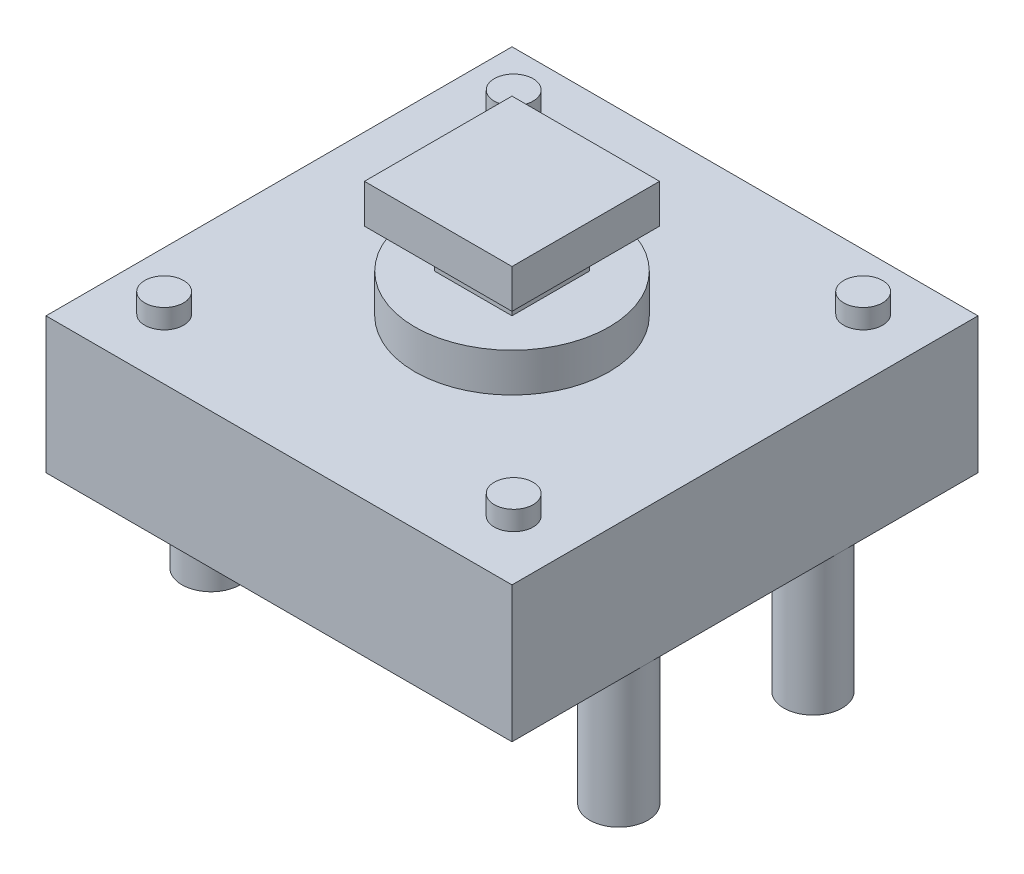
ISO-10303-21;
HEADER;
FILE_DESCRIPTION(('STEP AP214'),'2;1');
FILE_NAME('part.step','',(''),(''),'','','');
FILE_SCHEMA(('AUTOMOTIVE_DESIGN { 1 0 10303 214 1 1 1 1 }'));
ENDSEC;
DATA;
#1=APPLICATION_CONTEXT('core data for automotive mechanical design processes');
#2=APPLICATION_PROTOCOL_DEFINITION('international standard','automotive_design',2000,#1);
#3=PRODUCT_CONTEXT('',#1,'mechanical');
#4=PRODUCT('Part','Part','',(#3));
#5=PRODUCT_RELATED_PRODUCT_CATEGORY('part','',(#4));
#6=PRODUCT_DEFINITION_FORMATION('','',#4);
#7=PRODUCT_DEFINITION_CONTEXT('part definition',#1,'design');
#8=PRODUCT_DEFINITION('design','',#6,#7);
#9=PRODUCT_DEFINITION_SHAPE('','',#8);
#10=(LENGTH_UNIT() NAMED_UNIT(*) SI_UNIT(.MILLI.,.METRE.));
#11=(NAMED_UNIT(*) PLANE_ANGLE_UNIT() SI_UNIT($,.RADIAN.));
#12=(NAMED_UNIT(*) SI_UNIT($,.STERADIAN.) SOLID_ANGLE_UNIT());
#13=UNCERTAINTY_MEASURE_WITH_UNIT(LENGTH_MEASURE(1.E-05),#10,'distance_accuracy_value','');
#14=(GEOMETRIC_REPRESENTATION_CONTEXT(3) GLOBAL_UNCERTAINTY_ASSIGNED_CONTEXT((#13)) GLOBAL_UNIT_ASSIGNED_CONTEXT((#10,
#11,#12)) REPRESENTATION_CONTEXT('',''));
#15=CARTESIAN_POINT('',(0.,0.,0.));
#16=DIRECTION('',(0.,0.,1.));
#17=DIRECTION('',(1.,0.,0.));
#18=AXIS2_PLACEMENT_3D('',#15,#16,#17);
#19=CARTESIAN_POINT('',(-6.,3.5,6.));
#20=DIRECTION('',(1.,0.,0.));
#21=DIRECTION('',(0.,0.,-1.));
#22=AXIS2_PLACEMENT_3D('',#19,#20,#21);
#23=PLANE('',#22);
#24=DIRECTION('',(0.,0.,1.));
#25=VECTOR('',#24,1.);
#26=CARTESIAN_POINT('',(-6.,0.,6.));
#27=LINE('',#26,#25);
#28=CARTESIAN_POINT('',(-6.,0.,-6.));
#29=VERTEX_POINT('',#28);
#30=CARTESIAN_POINT('',(-6.,0.,-2.5));
#31=VERTEX_POINT('',#30);
#32=EDGE_CURVE('E196',#29,#31,#27,.T.);
#33=ORIENTED_EDGE('',*,*,#32,.T.);
#34=CARTESIAN_POINT('',(-6.,0.,2.5));
#35=VERTEX_POINT('',#34);
#36=EDGE_CURVE('E192',#31,#35,#27,.T.);
#37=ORIENTED_EDGE('',*,*,#36,.T.);
#38=CARTESIAN_POINT('',(-6.,0.,6.));
#39=VERTEX_POINT('',#38);
#40=EDGE_CURVE('E190',#35,#39,#27,.T.);
#41=ORIENTED_EDGE('',*,*,#40,.T.);
#42=DIRECTION('',(0.,-1.,0.));
#43=VECTOR('',#42,1.);
#44=CARTESIAN_POINT('',(-6.,3.5,6.));
#45=LINE('',#44,#43);
#46=CARTESIAN_POINT('',(-6.,3.5,6.));
#47=VERTEX_POINT('',#46);
#48=EDGE_CURVE('E44',#47,#39,#45,.T.);
#49=ORIENTED_EDGE('',*,*,#48,.F.);
#50=DIRECTION('',(0.,0.,1.));
#51=VECTOR('',#50,1.);
#52=CARTESIAN_POINT('',(-6.,3.5,6.));
#53=LINE('',#52,#51);
#54=CARTESIAN_POINT('',(-6.,3.5,-6.));
#55=VERTEX_POINT('',#54);
#56=EDGE_CURVE('E170',#55,#47,#53,.T.);
#57=ORIENTED_EDGE('',*,*,#56,.F.);
#58=DIRECTION('',(0.,-1.,0.));
#59=VECTOR('',#58,1.);
#60=CARTESIAN_POINT('',(-6.,3.5,-6.));
#61=LINE('',#60,#59);
#62=EDGE_CURVE('E171',#55,#29,#61,.T.);
#63=ORIENTED_EDGE('',*,*,#62,.T.);
#64=EDGE_LOOP('',(#33,#37,#41,#49,#57,#63));
#65=FACE_BOUND('',#64,.T.);
#66=ADVANCED_FACE('F41',(#65),#23,.F.);
#67=CARTESIAN_POINT('',(6.,3.5,6.));
#68=DIRECTION('',(0.,0.,-1.));
#69=DIRECTION('',(-1.,0.,0.));
#70=AXIS2_PLACEMENT_3D('',#67,#68,#69);
#71=PLANE('',#70);
#72=DIRECTION('',(1.,0.,0.));
#73=VECTOR('',#72,1.);
#74=CARTESIAN_POINT('',(6.,0.,6.));
#75=LINE('',#74,#73);
#76=CARTESIAN_POINT('',(6.,0.,6.));
#77=VERTEX_POINT('',#76);
#78=EDGE_CURVE('E164',#39,#77,#75,.T.);
#79=ORIENTED_EDGE('',*,*,#78,.T.);
#80=DIRECTION('',(0.,-1.,0.));
#81=VECTOR('',#80,1.);
#82=CARTESIAN_POINT('',(6.,3.5,6.));
#83=LINE('',#82,#81);
#84=CARTESIAN_POINT('',(6.,3.5,6.));
#85=VERTEX_POINT('',#84);
#86=EDGE_CURVE('E148',#85,#77,#83,.T.);
#87=ORIENTED_EDGE('',*,*,#86,.F.);
#88=DIRECTION('',(1.,0.,0.));
#89=VECTOR('',#88,1.);
#90=CARTESIAN_POINT('',(6.,3.5,6.));
#91=LINE('',#90,#89);
#92=EDGE_CURVE('E185',#47,#85,#91,.T.);
#93=ORIENTED_EDGE('',*,*,#92,.F.);
#94=ORIENTED_EDGE('',*,*,#48,.T.);
#95=EDGE_LOOP('',(#79,#87,#93,#94));
#96=FACE_BOUND('',#95,.T.);
#97=ADVANCED_FACE('F184',(#96),#71,.F.);
#98=CARTESIAN_POINT('',(6.,3.5,6.));
#99=DIRECTION('',(-1.,0.,0.));
#100=DIRECTION('',(0.,0.,1.));
#101=AXIS2_PLACEMENT_3D('',#98,#99,#100);
#102=PLANE('',#101);
#103=DIRECTION('',(0.,0.,-1.));
#104=VECTOR('',#103,1.);
#105=CARTESIAN_POINT('',(6.,0.,6.));
#106=LINE('',#105,#104);
#107=CARTESIAN_POINT('',(6.,0.,2.5));
#108=VERTEX_POINT('',#107);
#109=EDGE_CURVE('E141',#77,#108,#106,.T.);
#110=ORIENTED_EDGE('',*,*,#109,.T.);
#111=CARTESIAN_POINT('',(6.,0.,-2.5));
#112=VERTEX_POINT('',#111);
#113=EDGE_CURVE('E144',#108,#112,#106,.T.);
#114=ORIENTED_EDGE('',*,*,#113,.T.);
#115=CARTESIAN_POINT('',(6.,0.,-6.));
#116=VERTEX_POINT('',#115);
#117=EDGE_CURVE('E155',#112,#116,#106,.T.);
#118=ORIENTED_EDGE('',*,*,#117,.T.);
#119=DIRECTION('',(0.,-1.,0.));
#120=VECTOR('',#119,1.);
#121=CARTESIAN_POINT('',(6.,3.5,-6.));
#122=LINE('',#121,#120);
#123=CARTESIAN_POINT('',(6.,3.5,-6.));
#124=VERTEX_POINT('',#123);
#125=EDGE_CURVE('E175',#124,#116,#122,.T.);
#126=ORIENTED_EDGE('',*,*,#125,.F.);
#127=DIRECTION('',(0.,0.,-1.));
#128=VECTOR('',#127,1.);
#129=CARTESIAN_POINT('',(6.,3.5,6.));
#130=LINE('',#129,#128);
#131=EDGE_CURVE('E204',#85,#124,#130,.T.);
#132=ORIENTED_EDGE('',*,*,#131,.F.);
#133=ORIENTED_EDGE('',*,*,#86,.T.);
#134=EDGE_LOOP('',(#110,#114,#118,#126,#132,#133));
#135=FACE_BOUND('',#134,.T.);
#136=ADVANCED_FACE('F143',(#135),#102,.F.);
#137=CARTESIAN_POINT('',(6.,3.5,-6.));
#138=DIRECTION('',(0.,0.,1.));
#139=DIRECTION('',(1.,0.,0.));
#140=AXIS2_PLACEMENT_3D('',#137,#138,#139);
#141=PLANE('',#140);
#142=DIRECTION('',(-1.,0.,0.));
#143=VECTOR('',#142,1.);
#144=CARTESIAN_POINT('',(6.,0.,-6.));
#145=LINE('',#144,#143);
#146=EDGE_CURVE('E153',#116,#29,#145,.T.);
#147=ORIENTED_EDGE('',*,*,#146,.T.);
#148=ORIENTED_EDGE('',*,*,#62,.F.);
#149=DIRECTION('',(-1.,0.,0.));
#150=VECTOR('',#149,1.);
#151=CARTESIAN_POINT('',(6.,3.5,-6.));
#152=LINE('',#151,#150);
#153=EDGE_CURVE('E176',#124,#55,#152,.T.);
#154=ORIENTED_EDGE('',*,*,#153,.F.);
#155=ORIENTED_EDGE('',*,*,#125,.T.);
#156=EDGE_LOOP('',(#147,#148,#154,#155));
#157=FACE_BOUND('',#156,.T.);
#158=ADVANCED_FACE('F382',(#157),#141,.F.);
#159=CARTESIAN_POINT('',(0.,3.5,0.));
#160=DIRECTION('',(0.,1.,0.));
#161=DIRECTION('',(0.,0.,1.));
#162=AXIS2_PLACEMENT_3D('',#159,#160,#161);
#163=PLANE('',#162);
#164=CARTESIAN_POINT('',(4.48273903997633,3.5,-4.56041336008283));
#165=DIRECTION('',(0.,1.,0.));
#166=DIRECTION('',(0.,0.,-1.));
#167=AXIS2_PLACEMENT_3D('',#164,#165,#166);
#168=CIRCLE('',#167,0.500000000000001);
#169=CARTESIAN_POINT('',(4.48273903997633,3.5,-5.06041336008283));
#170=VERTEX_POINT('',#169);
#171=EDGE_CURVE('E239',#170,#170,#168,.T.);
#172=ORIENTED_EDGE('',*,*,#171,.F.);
#173=EDGE_LOOP('',(#172));
#174=FACE_BOUND('',#173,.T.);
#175=CARTESIAN_POINT('',(4.48273903997633,3.5,4.43958663991717));
#176=DIRECTION('',(0.,1.,0.));
#177=DIRECTION('',(0.,0.,1.));
#178=AXIS2_PLACEMENT_3D('',#175,#176,#177);
#179=CIRCLE('',#178,0.500000000000001);
#180=CARTESIAN_POINT('',(4.48273903997633,3.5,4.93958663991717));
#181=VERTEX_POINT('',#180);
#182=EDGE_CURVE('E231',#181,#181,#179,.T.);
#183=ORIENTED_EDGE('',*,*,#182,.F.);
#184=EDGE_LOOP('',(#183));
#185=FACE_BOUND('',#184,.T.);
#186=CARTESIAN_POINT('',(-4.51726096002366,3.5,4.43958663991717));
#187=DIRECTION('',(0.,1.,0.));
#188=DIRECTION('',(0.,0.,-1.));
#189=AXIS2_PLACEMENT_3D('',#186,#187,#188);
#190=CIRCLE('',#189,0.500000000000001);
#191=CARTESIAN_POINT('',(-4.51726096002366,3.5,3.93958663991717));
#192=VERTEX_POINT('',#191);
#193=EDGE_CURVE('E223',#192,#192,#190,.T.);
#194=ORIENTED_EDGE('',*,*,#193,.F.);
#195=EDGE_LOOP('',(#194));
#196=FACE_BOUND('',#195,.T.);
#197=CARTESIAN_POINT('',(-4.51726096002367,3.5,-4.56041336008283));
#198=DIRECTION('',(0.,1.,0.));
#199=DIRECTION('',(0.,0.,1.));
#200=AXIS2_PLACEMENT_3D('',#197,#198,#199);
#201=CIRCLE('',#200,0.500000000000001);
#202=CARTESIAN_POINT('',(-4.51726096002367,3.5,-4.06041336008283));
#203=VERTEX_POINT('',#202);
#204=EDGE_CURVE('E215',#203,#203,#201,.T.);
#205=ORIENTED_EDGE('',*,*,#204,.F.);
#206=EDGE_LOOP('',(#205));
#207=FACE_BOUND('',#206,.T.);
#208=CARTESIAN_POINT('',(0.,3.5,0.));
#209=DIRECTION('',(0.,1.,0.));
#210=DIRECTION('',(0.,0.,1.));
#211=AXIS2_PLACEMENT_3D('',#208,#209,#210);
#212=CIRCLE('',#211,2.5);
#213=CARTESIAN_POINT('',(0.,3.5,2.5));
#214=VERTEX_POINT('',#213);
#215=EDGE_CURVE('E11',#214,#214,#212,.T.);
#216=ORIENTED_EDGE('',*,*,#215,.F.);
#217=EDGE_LOOP('',(#216));
#218=FACE_BOUND('',#217,.T.);
#219=ORIENTED_EDGE('',*,*,#56,.T.);
#220=ORIENTED_EDGE('',*,*,#92,.T.);
#221=ORIENTED_EDGE('',*,*,#131,.T.);
#222=ORIENTED_EDGE('',*,*,#153,.T.);
#223=EDGE_LOOP('',(#219,#220,#221,#222));
#224=FACE_BOUND('',#223,.T.);
#225=ADVANCED_FACE('F387',(#174,#185,#196,#207,#218,#224),#163,.T.);
#226=CARTESIAN_POINT('',(0.,0.,0.));
#227=DIRECTION('',(0.,1.,0.));
#228=DIRECTION('',(0.,0.,1.));
#229=AXIS2_PLACEMENT_3D('',#226,#227,#228);
#230=PLANE('',#229);
#231=ORIENTED_EDGE('',*,*,#113,.F.);
#232=CARTESIAN_POINT('',(5.25,0.,2.5));
#233=DIRECTION('',(0.,-1.,0.));
#234=DIRECTION('',(0.,0.,1.));
#235=AXIS2_PLACEMENT_3D('',#232,#233,#234);
#236=CIRCLE('',#235,0.75);
#237=EDGE_CURVE('E159',#108,#108,#236,.T.);
#238=ORIENTED_EDGE('',*,*,#237,.F.);
#239=ORIENTED_EDGE('',*,*,#109,.F.);
#240=ORIENTED_EDGE('',*,*,#78,.F.);
#241=ORIENTED_EDGE('',*,*,#40,.F.);
#242=CARTESIAN_POINT('',(-5.25,0.,2.5));
#243=DIRECTION('',(0.,-1.,0.));
#244=DIRECTION('',(0.,0.,-1.));
#245=AXIS2_PLACEMENT_3D('',#242,#243,#244);
#246=CIRCLE('',#245,0.75);
#247=EDGE_CURVE('E332',#35,#35,#246,.T.);
#248=ORIENTED_EDGE('',*,*,#247,.F.);
#249=ORIENTED_EDGE('',*,*,#36,.F.);
#250=CARTESIAN_POINT('',(-5.25,0.,-2.5));
#251=DIRECTION('',(0.,-1.,0.));
#252=DIRECTION('',(0.,0.,1.));
#253=AXIS2_PLACEMENT_3D('',#250,#251,#252);
#254=CIRCLE('',#253,0.75);
#255=EDGE_CURVE('E340',#31,#31,#254,.T.);
#256=ORIENTED_EDGE('',*,*,#255,.F.);
#257=ORIENTED_EDGE('',*,*,#32,.F.);
#258=ORIENTED_EDGE('',*,*,#146,.F.);
#259=ORIENTED_EDGE('',*,*,#117,.F.);
#260=CARTESIAN_POINT('',(5.25,0.,-2.5));
#261=DIRECTION('',(0.,-1.,0.));
#262=DIRECTION('',(0.,0.,-1.));
#263=AXIS2_PLACEMENT_3D('',#260,#261,#262);
#264=CIRCLE('',#263,0.75);
#265=EDGE_CURVE('E161',#112,#112,#264,.T.);
#266=ORIENTED_EDGE('',*,*,#265,.F.);
#267=EDGE_LOOP('',(#231,#238,#239,#240,#241,#248,#249,#256,#257,#258,#259,#266));
#268=FACE_BOUND('',#267,.T.);
#269=ADVANCED_FACE('F157',(#268),#230,.F.);
#270=CARTESIAN_POINT('',(0.,4.5,0.));
#271=DIRECTION('',(0.,-1.,0.));
#272=DIRECTION('',(0.,0.,-1.));
#273=AXIS2_PLACEMENT_3D('',#270,#271,#272);
#274=CYLINDRICAL_SURFACE('',#273,2.5);
#275=CARTESIAN_POINT('',(0.,4.5,0.));
#276=DIRECTION('',(0.,1.,0.));
#277=DIRECTION('',(0.,0.,1.));
#278=AXIS2_PLACEMENT_3D('',#275,#276,#277);
#279=CIRCLE('',#278,2.5);
#280=CARTESIAN_POINT('',(0.,4.5,2.5));
#281=VERTEX_POINT('',#280);
#282=EDGE_CURVE('E195',#281,#281,#279,.T.);
#283=ORIENTED_EDGE('',*,*,#282,.F.);
#284=EDGE_LOOP('',(#283));
#285=FACE_BOUND('',#284,.T.);
#286=ORIENTED_EDGE('',*,*,#215,.T.);
#287=EDGE_LOOP('',(#286));
#288=FACE_BOUND('',#287,.T.);
#289=ADVANCED_FACE('F391',(#285,#288),#274,.T.);
#290=CARTESIAN_POINT('',(0.,4.5,0.));
#291=DIRECTION('',(0.,1.,0.));
#292=DIRECTION('',(0.,0.,1.));
#293=AXIS2_PLACEMENT_3D('',#290,#291,#292);
#294=PLANE('',#293);
#295=DIRECTION('',(0.,0.,1.));
#296=VECTOR('',#295,1.);
#297=CARTESIAN_POINT('',(-1.,4.5,1.));
#298=LINE('',#297,#296);
#299=CARTESIAN_POINT('',(-1.,4.5,-1.));
#300=VERTEX_POINT('',#299);
#301=CARTESIAN_POINT('',(-1.,4.5,1.));
#302=VERTEX_POINT('',#301);
#303=EDGE_CURVE('E57',#300,#302,#298,.T.);
#304=ORIENTED_EDGE('',*,*,#303,.F.);
#305=DIRECTION('',(-1.,0.,0.));
#306=VECTOR('',#305,1.);
#307=CARTESIAN_POINT('',(1.,4.5,-1.));
#308=LINE('',#307,#306);
#309=CARTESIAN_POINT('',(1.,4.5,-1.));
#310=VERTEX_POINT('',#309);
#311=EDGE_CURVE('E61',#310,#300,#308,.T.);
#312=ORIENTED_EDGE('',*,*,#311,.F.);
#313=DIRECTION('',(0.,0.,-1.));
#314=VECTOR('',#313,1.);
#315=CARTESIAN_POINT('',(1.,4.5,1.));
#316=LINE('',#315,#314);
#317=CARTESIAN_POINT('',(1.,4.5,1.));
#318=VERTEX_POINT('',#317);
#319=EDGE_CURVE('E266',#318,#310,#316,.T.);
#320=ORIENTED_EDGE('',*,*,#319,.F.);
#321=DIRECTION('',(1.,0.,0.));
#322=VECTOR('',#321,1.);
#323=CARTESIAN_POINT('',(1.,4.5,1.));
#324=LINE('',#323,#322);
#325=EDGE_CURVE('E269',#302,#318,#324,.T.);
#326=ORIENTED_EDGE('',*,*,#325,.F.);
#327=EDGE_LOOP('',(#304,#312,#320,#326));
#328=FACE_BOUND('',#327,.T.);
#329=ORIENTED_EDGE('',*,*,#282,.T.);
#330=EDGE_LOOP('',(#329));
#331=FACE_BOUND('',#330,.T.);
#332=ADVANCED_FACE('F397',(#328,#331),#294,.T.);
#333=CARTESIAN_POINT('',(-4.51726096002367,4.,-4.56041336008283));
#334=DIRECTION('',(0.,-1.,0.));
#335=DIRECTION('',(0.,0.,-1.));
#336=AXIS2_PLACEMENT_3D('',#333,#334,#335);
#337=CYLINDRICAL_SURFACE('',#336,0.500000000000001);
#338=CARTESIAN_POINT('',(-4.51726096002367,4.,-4.56041336008283));
#339=DIRECTION('',(0.,1.,0.));
#340=DIRECTION('',(0.,0.,1.));
#341=AXIS2_PLACEMENT_3D('',#338,#339,#340);
#342=CIRCLE('',#341,0.500000000000001);
#343=CARTESIAN_POINT('',(-4.51726096002367,4.,-4.06041336008283));
#344=VERTEX_POINT('',#343);
#345=EDGE_CURVE('E214',#344,#344,#342,.T.);
#346=ORIENTED_EDGE('',*,*,#345,.F.);
#347=EDGE_LOOP('',(#346));
#348=FACE_BOUND('',#347,.T.);
#349=ORIENTED_EDGE('',*,*,#204,.T.);
#350=EDGE_LOOP('',(#349));
#351=FACE_BOUND('',#350,.T.);
#352=ADVANCED_FACE('F401',(#348,#351),#337,.T.);
#353=CARTESIAN_POINT('',(-4.51726096002367,4.,-4.56041336008283));
#354=DIRECTION('',(0.,1.,0.));
#355=DIRECTION('',(0.,0.,1.));
#356=AXIS2_PLACEMENT_3D('',#353,#354,#355);
#357=PLANE('',#356);
#358=ORIENTED_EDGE('',*,*,#345,.T.);
#359=EDGE_LOOP('',(#358));
#360=FACE_BOUND('',#359,.T.);
#361=ADVANCED_FACE('F404',(#360),#357,.T.);
#362=CARTESIAN_POINT('',(-4.51726096002366,4.,4.43958663991717));
#363=DIRECTION('',(0.,-1.,0.));
#364=DIRECTION('',(0.,0.,-1.));
#365=AXIS2_PLACEMENT_3D('',#362,#363,#364);
#366=CYLINDRICAL_SURFACE('',#365,0.500000000000001);
#367=CARTESIAN_POINT('',(-4.51726096002366,4.,4.43958663991717));
#368=DIRECTION('',(0.,1.,0.));
#369=DIRECTION('',(0.,0.,-1.));
#370=AXIS2_PLACEMENT_3D('',#367,#368,#369);
#371=CIRCLE('',#370,0.500000000000001);
#372=CARTESIAN_POINT('',(-4.51726096002366,4.,3.93958663991717));
#373=VERTEX_POINT('',#372);
#374=EDGE_CURVE('E219',#373,#373,#371,.T.);
#375=ORIENTED_EDGE('',*,*,#374,.F.);
#376=EDGE_LOOP('',(#375));
#377=FACE_BOUND('',#376,.T.);
#378=ORIENTED_EDGE('',*,*,#193,.T.);
#379=EDGE_LOOP('',(#378));
#380=FACE_BOUND('',#379,.T.);
#381=ADVANCED_FACE('F408',(#377,#380),#366,.T.);
#382=CARTESIAN_POINT('',(-4.51726096002366,4.,4.43958663991717));
#383=DIRECTION('',(0.,-1.,0.));
#384=DIRECTION('',(0.,0.,-1.));
#385=AXIS2_PLACEMENT_3D('',#382,#383,#384);
#386=PLANE('',#385);
#387=ORIENTED_EDGE('',*,*,#374,.T.);
#388=EDGE_LOOP('',(#387));
#389=FACE_BOUND('',#388,.T.);
#390=ADVANCED_FACE('F412',(#389),#386,.F.);
#391=CARTESIAN_POINT('',(4.48273903997633,4.,4.43958663991717));
#392=DIRECTION('',(0.,-1.,0.));
#393=DIRECTION('',(0.,0.,-1.));
#394=AXIS2_PLACEMENT_3D('',#391,#392,#393);
#395=CYLINDRICAL_SURFACE('',#394,0.500000000000001);
#396=CARTESIAN_POINT('',(4.48273903997633,4.,4.43958663991717));
#397=DIRECTION('',(0.,1.,0.));
#398=DIRECTION('',(0.,0.,1.));
#399=AXIS2_PLACEMENT_3D('',#396,#397,#398);
#400=CIRCLE('',#399,0.500000000000001);
#401=CARTESIAN_POINT('',(4.48273903997633,4.,4.93958663991717));
#402=VERTEX_POINT('',#401);
#403=EDGE_CURVE('E227',#402,#402,#400,.T.);
#404=ORIENTED_EDGE('',*,*,#403,.F.);
#405=EDGE_LOOP('',(#404));
#406=FACE_BOUND('',#405,.T.);
#407=ORIENTED_EDGE('',*,*,#182,.T.);
#408=EDGE_LOOP('',(#407));
#409=FACE_BOUND('',#408,.T.);
#410=ADVANCED_FACE('F416',(#406,#409),#395,.T.);
#411=CARTESIAN_POINT('',(4.48273903997633,4.,4.43958663991717));
#412=DIRECTION('',(0.,1.,0.));
#413=DIRECTION('',(0.,0.,1.));
#414=AXIS2_PLACEMENT_3D('',#411,#412,#413);
#415=PLANE('',#414);
#416=ORIENTED_EDGE('',*,*,#403,.T.);
#417=EDGE_LOOP('',(#416));
#418=FACE_BOUND('',#417,.T.);
#419=ADVANCED_FACE('F420',(#418),#415,.T.);
#420=CARTESIAN_POINT('',(4.48273903997633,4.,-4.56041336008283));
#421=DIRECTION('',(0.,-1.,0.));
#422=DIRECTION('',(0.,0.,-1.));
#423=AXIS2_PLACEMENT_3D('',#420,#421,#422);
#424=CYLINDRICAL_SURFACE('',#423,0.500000000000001);
#425=CARTESIAN_POINT('',(4.48273903997633,4.,-4.56041336008283));
#426=DIRECTION('',(0.,1.,0.));
#427=DIRECTION('',(0.,0.,-1.));
#428=AXIS2_PLACEMENT_3D('',#425,#426,#427);
#429=CIRCLE('',#428,0.500000000000001);
#430=CARTESIAN_POINT('',(4.48273903997633,4.,-5.06041336008283));
#431=VERTEX_POINT('',#430);
#432=EDGE_CURVE('E235',#431,#431,#429,.T.);
#433=ORIENTED_EDGE('',*,*,#432,.F.);
#434=EDGE_LOOP('',(#433));
#435=FACE_BOUND('',#434,.T.);
#436=ORIENTED_EDGE('',*,*,#171,.T.);
#437=EDGE_LOOP('',(#436));
#438=FACE_BOUND('',#437,.T.);
#439=ADVANCED_FACE('F424',(#435,#438),#424,.T.);
#440=CARTESIAN_POINT('',(4.48273903997633,4.,-4.56041336008283));
#441=DIRECTION('',(0.,-1.,0.));
#442=DIRECTION('',(0.,0.,-1.));
#443=AXIS2_PLACEMENT_3D('',#440,#441,#442);
#444=PLANE('',#443);
#445=ORIENTED_EDGE('',*,*,#432,.T.);
#446=EDGE_LOOP('',(#445));
#447=FACE_BOUND('',#446,.T.);
#448=ADVANCED_FACE('F428',(#447),#444,.F.);
#449=CARTESIAN_POINT('',(-1.,5.5,1.));
#450=DIRECTION('',(1.,0.,0.));
#451=DIRECTION('',(0.,0.,-1.));
#452=AXIS2_PLACEMENT_3D('',#449,#450,#451);
#453=PLANE('',#452);
#454=ORIENTED_EDGE('',*,*,#303,.T.);
#455=DIRECTION('',(0.,-1.,0.));
#456=VECTOR('',#455,1.);
#457=CARTESIAN_POINT('',(-1.,5.5,1.));
#458=LINE('',#457,#456);
#459=CARTESIAN_POINT('',(-1.,5.5,1.));
#460=VERTEX_POINT('',#459);
#461=EDGE_CURVE('E243',#460,#302,#458,.T.);
#462=ORIENTED_EDGE('',*,*,#461,.F.);
#463=DIRECTION('',(0.,0.,1.));
#464=VECTOR('',#463,1.);
#465=CARTESIAN_POINT('',(-1.,5.5,1.));
#466=LINE('',#465,#464);
#467=CARTESIAN_POINT('',(-1.,5.5,-1.));
#468=VERTEX_POINT('',#467);
#469=EDGE_CURVE('E265',#468,#460,#466,.T.);
#470=ORIENTED_EDGE('',*,*,#469,.F.);
#471=DIRECTION('',(0.,-1.,0.));
#472=VECTOR('',#471,1.);
#473=CARTESIAN_POINT('',(-1.,5.5,-1.));
#474=LINE('',#473,#472);
#475=EDGE_CURVE('E258',#468,#300,#474,.T.);
#476=ORIENTED_EDGE('',*,*,#475,.T.);
#477=EDGE_LOOP('',(#454,#462,#470,#476));
#478=FACE_BOUND('',#477,.T.);
#479=ADVANCED_FACE('F432',(#478),#453,.F.);
#480=CARTESIAN_POINT('',(1.,5.5,1.));
#481=DIRECTION('',(0.,0.,-1.));
#482=DIRECTION('',(-1.,0.,0.));
#483=AXIS2_PLACEMENT_3D('',#480,#481,#482);
#484=PLANE('',#483);
#485=ORIENTED_EDGE('',*,*,#325,.T.);
#486=DIRECTION('',(0.,-1.,0.));
#487=VECTOR('',#486,1.);
#488=CARTESIAN_POINT('',(1.,5.5,1.));
#489=LINE('',#488,#487);
#490=CARTESIAN_POINT('',(1.,5.5,1.));
#491=VERTEX_POINT('',#490);
#492=EDGE_CURVE('E250',#491,#318,#489,.T.);
#493=ORIENTED_EDGE('',*,*,#492,.F.);
#494=DIRECTION('',(1.,0.,0.));
#495=VECTOR('',#494,1.);
#496=CARTESIAN_POINT('',(1.,5.5,1.));
#497=LINE('',#496,#495);
#498=EDGE_CURVE('E283',#460,#491,#497,.T.);
#499=ORIENTED_EDGE('',*,*,#498,.F.);
#500=ORIENTED_EDGE('',*,*,#461,.T.);
#501=EDGE_LOOP('',(#485,#493,#499,#500));
#502=FACE_BOUND('',#501,.T.);
#503=ADVANCED_FACE('F436',(#502),#484,.F.);
#504=CARTESIAN_POINT('',(1.,5.5,1.));
#505=DIRECTION('',(-1.,0.,0.));
#506=DIRECTION('',(0.,0.,1.));
#507=AXIS2_PLACEMENT_3D('',#504,#505,#506);
#508=PLANE('',#507);
#509=ORIENTED_EDGE('',*,*,#319,.T.);
#510=DIRECTION('',(0.,-1.,0.));
#511=VECTOR('',#510,1.);
#512=CARTESIAN_POINT('',(1.,5.5,-1.));
#513=LINE('',#512,#511);
#514=CARTESIAN_POINT('',(1.,5.5,-1.));
#515=VERTEX_POINT('',#514);
#516=EDGE_CURVE('E254',#515,#310,#513,.T.);
#517=ORIENTED_EDGE('',*,*,#516,.F.);
#518=DIRECTION('',(0.,0.,-1.));
#519=VECTOR('',#518,1.);
#520=CARTESIAN_POINT('',(1.,5.5,1.));
#521=LINE('',#520,#519);
#522=EDGE_CURVE('E279',#491,#515,#521,.T.);
#523=ORIENTED_EDGE('',*,*,#522,.F.);
#524=ORIENTED_EDGE('',*,*,#492,.T.);
#525=EDGE_LOOP('',(#509,#517,#523,#524));
#526=FACE_BOUND('',#525,.T.);
#527=ADVANCED_FACE('F440',(#526),#508,.F.);
#528=CARTESIAN_POINT('',(1.,5.5,-1.));
#529=DIRECTION('',(0.,0.,1.));
#530=DIRECTION('',(1.,0.,0.));
#531=AXIS2_PLACEMENT_3D('',#528,#529,#530);
#532=PLANE('',#531);
#533=ORIENTED_EDGE('',*,*,#311,.T.);
#534=ORIENTED_EDGE('',*,*,#475,.F.);
#535=DIRECTION('',(-1.,0.,0.));
#536=VECTOR('',#535,1.);
#537=CARTESIAN_POINT('',(1.,5.5,-1.));
#538=LINE('',#537,#536);
#539=EDGE_CURVE('E262',#515,#468,#538,.T.);
#540=ORIENTED_EDGE('',*,*,#539,.F.);
#541=ORIENTED_EDGE('',*,*,#516,.T.);
#542=EDGE_LOOP('',(#533,#534,#540,#541));
#543=FACE_BOUND('',#542,.T.);
#544=ADVANCED_FACE('F444',(#543),#532,.F.);
#545=CARTESIAN_POINT('',(0.,5.5,0.));
#546=DIRECTION('',(0.,1.,0.));
#547=DIRECTION('',(0.,0.,1.));
#548=AXIS2_PLACEMENT_3D('',#545,#546,#547);
#549=PLANE('',#548);
#550=DIRECTION('',(0.,0.,1.));
#551=VECTOR('',#550,1.);
#552=CARTESIAN_POINT('',(-1.9,5.5,1.9));
#553=LINE('',#552,#551);
#554=CARTESIAN_POINT('',(-1.9,5.5,-1.9));
#555=VERTEX_POINT('',#554);
#556=CARTESIAN_POINT('',(-1.9,5.5,1.9));
#557=VERTEX_POINT('',#556);
#558=EDGE_CURVE('E316',#555,#557,#553,.T.);
#559=ORIENTED_EDGE('',*,*,#558,.F.);
#560=DIRECTION('',(-1.,0.,0.));
#561=VECTOR('',#560,1.);
#562=CARTESIAN_POINT('',(1.9,5.5,-1.9));
#563=LINE('',#562,#561);
#564=CARTESIAN_POINT('',(1.9,5.5,-1.9));
#565=VERTEX_POINT('',#564);
#566=EDGE_CURVE('E306',#565,#555,#563,.T.);
#567=ORIENTED_EDGE('',*,*,#566,.F.);
#568=DIRECTION('',(0.,0.,-1.));
#569=VECTOR('',#568,1.);
#570=CARTESIAN_POINT('',(1.9,5.5,1.9));
#571=LINE('',#570,#569);
#572=CARTESIAN_POINT('',(1.9,5.5,1.9));
#573=VERTEX_POINT('',#572);
#574=EDGE_CURVE('E310',#573,#565,#571,.T.);
#575=ORIENTED_EDGE('',*,*,#574,.F.);
#576=DIRECTION('',(1.,0.,0.));
#577=VECTOR('',#576,1.);
#578=CARTESIAN_POINT('',(1.9,5.5,1.9));
#579=LINE('',#578,#577);
#580=EDGE_CURVE('E313',#557,#573,#579,.T.);
#581=ORIENTED_EDGE('',*,*,#580,.F.);
#582=EDGE_LOOP('',(#559,#567,#575,#581));
#583=FACE_BOUND('',#582,.T.);
#584=ORIENTED_EDGE('',*,*,#539,.T.);
#585=ORIENTED_EDGE('',*,*,#469,.T.);
#586=ORIENTED_EDGE('',*,*,#498,.T.);
#587=ORIENTED_EDGE('',*,*,#522,.T.);
#588=EDGE_LOOP('',(#584,#585,#586,#587));
#589=FACE_BOUND('',#588,.T.);
#590=ADVANCED_FACE('F448',(#583,#589),#549,.F.);
#591=CARTESIAN_POINT('',(-1.9,6.5,1.9));
#592=DIRECTION('',(1.,0.,0.));
#593=DIRECTION('',(0.,0.,-1.));
#594=AXIS2_PLACEMENT_3D('',#591,#592,#593);
#595=PLANE('',#594);
#596=ORIENTED_EDGE('',*,*,#558,.T.);
#597=DIRECTION('',(0.,-1.,0.));
#598=VECTOR('',#597,1.);
#599=CARTESIAN_POINT('',(-1.9,6.5,1.9));
#600=LINE('',#599,#598);
#601=CARTESIAN_POINT('',(-1.9,6.5,1.9));
#602=VERTEX_POINT('',#601);
#603=EDGE_CURVE('E275',#602,#557,#600,.T.);
#604=ORIENTED_EDGE('',*,*,#603,.F.);
#605=DIRECTION('',(0.,0.,1.));
#606=VECTOR('',#605,1.);
#607=CARTESIAN_POINT('',(-1.9,6.5,1.9));
#608=LINE('',#607,#606);
#609=CARTESIAN_POINT('',(-1.9,6.5,-1.9));
#610=VERTEX_POINT('',#609);
#611=EDGE_CURVE('E309',#610,#602,#608,.T.);
#612=ORIENTED_EDGE('',*,*,#611,.F.);
#613=DIRECTION('',(0.,-1.,0.));
#614=VECTOR('',#613,1.);
#615=CARTESIAN_POINT('',(-1.9,6.5,-1.9));
#616=LINE('',#615,#614);
#617=EDGE_CURVE('E301',#610,#555,#616,.T.);
#618=ORIENTED_EDGE('',*,*,#617,.T.);
#619=EDGE_LOOP('',(#596,#604,#612,#618));
#620=FACE_BOUND('',#619,.T.);
#621=ADVANCED_FACE('F450',(#620),#595,.F.);
#622=CARTESIAN_POINT('',(1.9,6.5,1.9));
#623=DIRECTION('',(0.,0.,-1.));
#624=DIRECTION('',(-1.,0.,0.));
#625=AXIS2_PLACEMENT_3D('',#622,#623,#624);
#626=PLANE('',#625);
#627=ORIENTED_EDGE('',*,*,#580,.T.);
#628=DIRECTION('',(0.,-1.,0.));
#629=VECTOR('',#628,1.);
#630=CARTESIAN_POINT('',(1.9,6.5,1.9));
#631=LINE('',#630,#629);
#632=CARTESIAN_POINT('',(1.9,6.5,1.9));
#633=VERTEX_POINT('',#632);
#634=EDGE_CURVE('E293',#633,#573,#631,.T.);
#635=ORIENTED_EDGE('',*,*,#634,.F.);
#636=DIRECTION('',(1.,0.,0.));
#637=VECTOR('',#636,1.);
#638=CARTESIAN_POINT('',(1.9,6.5,1.9));
#639=LINE('',#638,#637);
#640=EDGE_CURVE('E326',#602,#633,#639,.T.);
#641=ORIENTED_EDGE('',*,*,#640,.F.);
#642=ORIENTED_EDGE('',*,*,#603,.T.);
#643=EDGE_LOOP('',(#627,#635,#641,#642));
#644=FACE_BOUND('',#643,.T.);
#645=ADVANCED_FACE('F453',(#644),#626,.F.);
#646=CARTESIAN_POINT('',(1.9,6.5,1.9));
#647=DIRECTION('',(-1.,0.,0.));
#648=DIRECTION('',(0.,0.,1.));
#649=AXIS2_PLACEMENT_3D('',#646,#647,#648);
#650=PLANE('',#649);
#651=ORIENTED_EDGE('',*,*,#574,.T.);
#652=DIRECTION('',(0.,-1.,0.));
#653=VECTOR('',#652,1.);
#654=CARTESIAN_POINT('',(1.9,6.5,-1.9));
#655=LINE('',#654,#653);
#656=CARTESIAN_POINT('',(1.9,6.5,-1.9));
#657=VERTEX_POINT('',#656);
#658=EDGE_CURVE('E297',#657,#565,#655,.T.);
#659=ORIENTED_EDGE('',*,*,#658,.F.);
#660=DIRECTION('',(0.,0.,-1.));
#661=VECTOR('',#660,1.);
#662=CARTESIAN_POINT('',(1.9,6.5,1.9));
#663=LINE('',#662,#661);
#664=EDGE_CURVE('E323',#633,#657,#663,.T.);
#665=ORIENTED_EDGE('',*,*,#664,.F.);
#666=ORIENTED_EDGE('',*,*,#634,.T.);
#667=EDGE_LOOP('',(#651,#659,#665,#666));
#668=FACE_BOUND('',#667,.T.);
#669=ADVANCED_FACE('F457',(#668),#650,.F.);
#670=CARTESIAN_POINT('',(1.9,6.5,-1.9));
#671=DIRECTION('',(0.,0.,1.));
#672=DIRECTION('',(1.,0.,0.));
#673=AXIS2_PLACEMENT_3D('',#670,#671,#672);
#674=PLANE('',#673);
#675=ORIENTED_EDGE('',*,*,#566,.T.);
#676=ORIENTED_EDGE('',*,*,#617,.F.);
#677=DIRECTION('',(-1.,0.,0.));
#678=VECTOR('',#677,1.);
#679=CARTESIAN_POINT('',(1.9,6.5,-1.9));
#680=LINE('',#679,#678);
#681=EDGE_CURVE('E305',#657,#610,#680,.T.);
#682=ORIENTED_EDGE('',*,*,#681,.F.);
#683=ORIENTED_EDGE('',*,*,#658,.T.);
#684=EDGE_LOOP('',(#675,#676,#682,#683));
#685=FACE_BOUND('',#684,.T.);
#686=ADVANCED_FACE('F461',(#685),#674,.F.);
#687=CARTESIAN_POINT('',(0.,6.5,0.));
#688=DIRECTION('',(0.,1.,0.));
#689=DIRECTION('',(0.,0.,1.));
#690=AXIS2_PLACEMENT_3D('',#687,#688,#689);
#691=PLANE('',#690);
#692=ORIENTED_EDGE('',*,*,#611,.T.);
#693=ORIENTED_EDGE('',*,*,#640,.T.);
#694=ORIENTED_EDGE('',*,*,#664,.T.);
#695=ORIENTED_EDGE('',*,*,#681,.T.);
#696=EDGE_LOOP('',(#692,#693,#694,#695));
#697=FACE_BOUND('',#696,.T.);
#698=ADVANCED_FACE('F465',(#697),#691,.T.);
#699=CARTESIAN_POINT('',(-5.25,-3.5,2.5));
#700=DIRECTION('',(0.,1.,0.));
#701=DIRECTION('',(0.,0.,1.));
#702=AXIS2_PLACEMENT_3D('',#699,#700,#701);
#703=CYLINDRICAL_SURFACE('',#702,0.75);
#704=CARTESIAN_POINT('',(-5.25,-3.5,2.5));
#705=DIRECTION('',(0.,-1.,0.));
#706=DIRECTION('',(0.,0.,-1.));
#707=AXIS2_PLACEMENT_3D('',#704,#705,#706);
#708=CIRCLE('',#707,0.75);
#709=CARTESIAN_POINT('',(-5.25,-3.5,1.75));
#710=VERTEX_POINT('',#709);
#711=EDGE_CURVE('E320',#710,#710,#708,.T.);
#712=ORIENTED_EDGE('',*,*,#711,.F.);
#713=EDGE_LOOP('',(#712));
#714=FACE_BOUND('',#713,.T.);
#715=ORIENTED_EDGE('',*,*,#247,.T.);
#716=EDGE_LOOP('',(#715));
#717=FACE_BOUND('',#716,.T.);
#718=ADVANCED_FACE('F472',(#714,#717),#703,.T.);
#719=CARTESIAN_POINT('',(-5.25,-3.5,2.5));
#720=DIRECTION('',(0.,-1.,0.));
#721=DIRECTION('',(0.,0.,-1.));
#722=AXIS2_PLACEMENT_3D('',#719,#720,#721);
#723=PLANE('',#722);
#724=ORIENTED_EDGE('',*,*,#711,.T.);
#725=EDGE_LOOP('',(#724));
#726=FACE_BOUND('',#725,.T.);
#727=ADVANCED_FACE('F476',(#726),#723,.T.);
#728=CARTESIAN_POINT('',(-5.25,-3.5,-2.5));
#729=DIRECTION('',(0.,1.,0.));
#730=DIRECTION('',(0.,0.,1.));
#731=AXIS2_PLACEMENT_3D('',#728,#729,#730);
#732=CYLINDRICAL_SURFACE('',#731,0.75);
#733=CARTESIAN_POINT('',(-5.25,-3.5,-2.5));
#734=DIRECTION('',(0.,-1.,0.));
#735=DIRECTION('',(0.,0.,1.));
#736=AXIS2_PLACEMENT_3D('',#733,#734,#735);
#737=CIRCLE('',#736,0.75);
#738=CARTESIAN_POINT('',(-5.25,-3.5,-1.75));
#739=VERTEX_POINT('',#738);
#740=EDGE_CURVE('E336',#739,#739,#737,.T.);
#741=ORIENTED_EDGE('',*,*,#740,.F.);
#742=EDGE_LOOP('',(#741));
#743=FACE_BOUND('',#742,.T.);
#744=ORIENTED_EDGE('',*,*,#255,.T.);
#745=EDGE_LOOP('',(#744));
#746=FACE_BOUND('',#745,.T.);
#747=ADVANCED_FACE('F480',(#743,#746),#732,.T.);
#748=CARTESIAN_POINT('',(-5.25,-3.5,-2.5));
#749=DIRECTION('',(0.,1.,0.));
#750=DIRECTION('',(0.,0.,1.));
#751=AXIS2_PLACEMENT_3D('',#748,#749,#750);
#752=PLANE('',#751);
#753=ORIENTED_EDGE('',*,*,#740,.T.);
#754=EDGE_LOOP('',(#753));
#755=FACE_BOUND('',#754,.T.);
#756=ADVANCED_FACE('F484',(#755),#752,.F.);
#757=CARTESIAN_POINT('',(5.25,-3.5,-2.5));
#758=DIRECTION('',(0.,1.,0.));
#759=DIRECTION('',(0.,0.,1.));
#760=AXIS2_PLACEMENT_3D('',#757,#758,#759);
#761=CYLINDRICAL_SURFACE('',#760,0.75);
#762=CARTESIAN_POINT('',(5.25,-3.5,-2.5));
#763=DIRECTION('',(0.,-1.,0.));
#764=DIRECTION('',(0.,0.,-1.));
#765=AXIS2_PLACEMENT_3D('',#762,#763,#764);
#766=CIRCLE('',#765,0.75);
#767=CARTESIAN_POINT('',(5.25,-3.5,-3.25));
#768=VERTEX_POINT('',#767);
#769=EDGE_CURVE('E344',#768,#768,#766,.T.);
#770=ORIENTED_EDGE('',*,*,#769,.F.);
#771=EDGE_LOOP('',(#770));
#772=FACE_BOUND('',#771,.T.);
#773=ORIENTED_EDGE('',*,*,#265,.T.);
#774=EDGE_LOOP('',(#773));
#775=FACE_BOUND('',#774,.T.);
#776=ADVANCED_FACE('F372',(#772,#775),#761,.T.);
#777=CARTESIAN_POINT('',(5.25,-3.5,-2.5));
#778=DIRECTION('',(0.,-1.,0.));
#779=DIRECTION('',(0.,0.,-1.));
#780=AXIS2_PLACEMENT_3D('',#777,#778,#779);
#781=PLANE('',#780);
#782=ORIENTED_EDGE('',*,*,#769,.T.);
#783=EDGE_LOOP('',(#782));
#784=FACE_BOUND('',#783,.T.);
#785=ADVANCED_FACE('F365',(#784),#781,.T.);
#786=CARTESIAN_POINT('',(5.25,-3.5,2.5));
#787=DIRECTION('',(0.,1.,0.));
#788=DIRECTION('',(0.,0.,1.));
#789=AXIS2_PLACEMENT_3D('',#786,#787,#788);
#790=CYLINDRICAL_SURFACE('',#789,0.75);
#791=CARTESIAN_POINT('',(5.25,-3.5,2.5));
#792=DIRECTION('',(0.,-1.,0.));
#793=DIRECTION('',(0.,0.,1.));
#794=AXIS2_PLACEMENT_3D('',#791,#792,#793);
#795=CIRCLE('',#794,0.75);
#796=CARTESIAN_POINT('',(5.25,-3.5,3.25));
#797=VERTEX_POINT('',#796);
#798=EDGE_CURVE('E350',#797,#797,#795,.T.);
#799=ORIENTED_EDGE('',*,*,#798,.F.);
#800=EDGE_LOOP('',(#799));
#801=FACE_BOUND('',#800,.T.);
#802=ORIENTED_EDGE('',*,*,#237,.T.);
#803=EDGE_LOOP('',(#802));
#804=FACE_BOUND('',#803,.T.);
#805=ADVANCED_FACE('F362',(#801,#804),#790,.T.);
#806=CARTESIAN_POINT('',(5.25,-3.5,2.5));
#807=DIRECTION('',(0.,1.,0.));
#808=DIRECTION('',(0.,0.,1.));
#809=AXIS2_PLACEMENT_3D('',#806,#807,#808);
#810=PLANE('',#809);
#811=ORIENTED_EDGE('',*,*,#798,.T.);
#812=EDGE_LOOP('',(#811));
#813=FACE_BOUND('',#812,.T.);
#814=ADVANCED_FACE('F360',(#813),#810,.F.);
#815=CLOSED_SHELL('',(#66,#97,#136,#158,#225,#269,#289,#332,#352,#361,#381,#390,#410,#419,#439,
#448,#479,#503,#527,#544,#590,#621,#645,#669,#686,#698,#718,#727,#747,#756,#776,#785,#805,#814));
#816=MANIFOLD_SOLID_BREP('B2',#815);
#817=ADVANCED_BREP_SHAPE_REPRESENTATION('',(#18,#816),#14);
#818=SHAPE_DEFINITION_REPRESENTATION(#9,#817);
ENDSEC;
END-ISO-10303-21;
